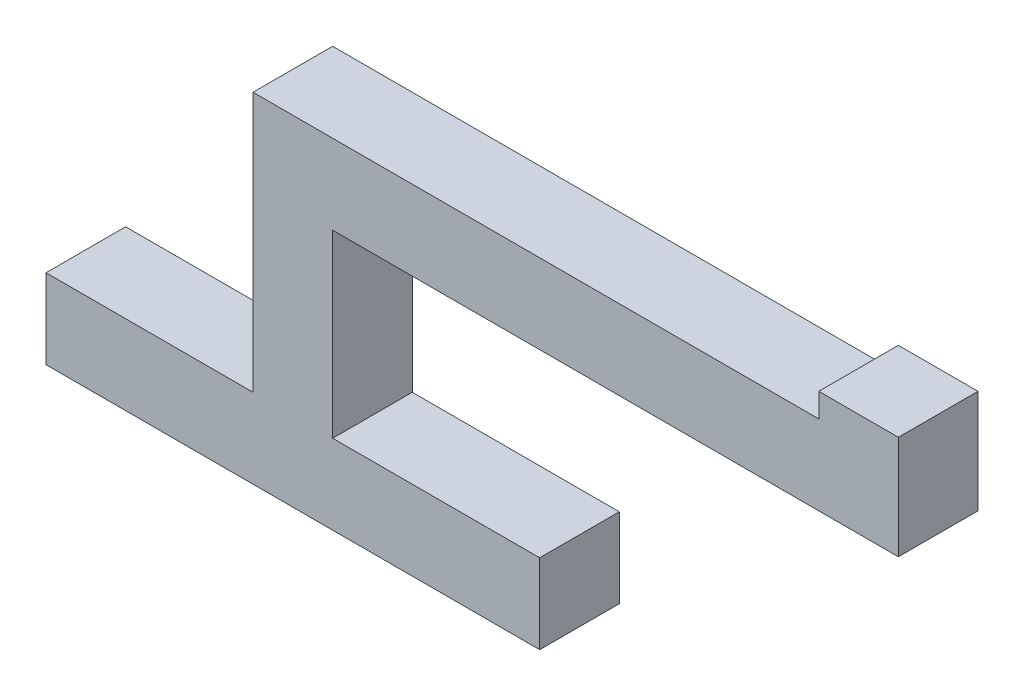
ISO-10303-21;
HEADER;
FILE_DESCRIPTION(('STEP AP214'),'2;1');
FILE_NAME('part.step','',(''),(''),'','','');
FILE_SCHEMA(('AUTOMOTIVE_DESIGN { 1 0 10303 214 1 1 1 1 }'));
ENDSEC;
DATA;
#1=APPLICATION_CONTEXT('core data for automotive mechanical design processes');
#2=APPLICATION_PROTOCOL_DEFINITION('international standard','automotive_design',2000,#1);
#3=PRODUCT_CONTEXT('',#1,'mechanical');
#4=PRODUCT('Part','Part','',(#3));
#5=PRODUCT_RELATED_PRODUCT_CATEGORY('part','',(#4));
#6=PRODUCT_DEFINITION_FORMATION('','',#4);
#7=PRODUCT_DEFINITION_CONTEXT('part definition',#1,'design');
#8=PRODUCT_DEFINITION('design','',#6,#7);
#9=PRODUCT_DEFINITION_SHAPE('','',#8);
#10=(LENGTH_UNIT() NAMED_UNIT(*) SI_UNIT(.MILLI.,.METRE.));
#11=(NAMED_UNIT(*) PLANE_ANGLE_UNIT() SI_UNIT($,.RADIAN.));
#12=(NAMED_UNIT(*) SI_UNIT($,.STERADIAN.) SOLID_ANGLE_UNIT());
#13=UNCERTAINTY_MEASURE_WITH_UNIT(LENGTH_MEASURE(1.E-05),#10,'distance_accuracy_value','');
#14=(GEOMETRIC_REPRESENTATION_CONTEXT(3) GLOBAL_UNCERTAINTY_ASSIGNED_CONTEXT((#13)) GLOBAL_UNIT_ASSIGNED_CONTEXT((#10,
#11,#12)) REPRESENTATION_CONTEXT('',''));
#15=CARTESIAN_POINT('',(0.,0.,0.));
#16=DIRECTION('',(0.,0.,1.));
#17=DIRECTION('',(1.,0.,0.));
#18=AXIS2_PLACEMENT_3D('',#15,#16,#17);
#19=CARTESIAN_POINT('',(-1.83420122950857,8.1168469934758,10.));
#20=DIRECTION('',(0.,-1.,0.));
#21=DIRECTION('',(1.,0.,0.));
#22=AXIS2_PLACEMENT_3D('',#19,#20,#21);
#23=PLANE('',#22);
#24=DIRECTION('',(-1.,0.,0.));
#25=VECTOR('',#24,1.);
#26=CARTESIAN_POINT('',(-1.83420122950857,8.1168469934758,0.));
#27=LINE('',#26,#25);
#28=CARTESIAN_POINT('',(-1.83420122950857,8.1168469934758,0.));
#29=VERTEX_POINT('',#28);
#30=CARTESIAN_POINT('',(-27.8342012295086,8.1168469934758,0.));
#31=VERTEX_POINT('',#30);
#32=EDGE_CURVE('E157',#29,#31,#27,.T.);
#33=ORIENTED_EDGE('',*,*,#32,.T.);
#34=DIRECTION('',(0.,0.,-1.));
#35=VECTOR('',#34,1.);
#36=CARTESIAN_POINT('',(-27.8342012295086,8.1168469934758,10.));
#37=LINE('',#36,#35);
#38=CARTESIAN_POINT('',(-27.8342012295086,8.1168469934758,10.));
#39=VERTEX_POINT('',#38);
#40=EDGE_CURVE('E11',#39,#31,#37,.T.);
#41=ORIENTED_EDGE('',*,*,#40,.F.);
#42=DIRECTION('',(-1.,0.,0.));
#43=VECTOR('',#42,1.);
#44=CARTESIAN_POINT('',(-1.83420122950857,8.1168469934758,10.));
#45=LINE('',#44,#43);
#46=CARTESIAN_POINT('',(-1.83420122950857,8.1168469934758,10.));
#47=VERTEX_POINT('',#46);
#48=EDGE_CURVE('E180',#47,#39,#45,.T.);
#49=ORIENTED_EDGE('',*,*,#48,.F.);
#50=DIRECTION('',(0.,0.,-1.));
#51=VECTOR('',#50,1.);
#52=CARTESIAN_POINT('',(-1.83420122950857,8.1168469934758,10.));
#53=LINE('',#52,#51);
#54=EDGE_CURVE('E153',#47,#29,#53,.T.);
#55=ORIENTED_EDGE('',*,*,#54,.T.);
#56=EDGE_LOOP('',(#33,#41,#49,#55));
#57=FACE_BOUND('',#56,.T.);
#58=ADVANCED_FACE('F37',(#57),#23,.F.);
#59=CARTESIAN_POINT('',(-27.8342012295086,8.1168469934758,10.));
#60=DIRECTION('',(-1.,0.,0.));
#61=DIRECTION('',(0.,0.,1.));
#62=AXIS2_PLACEMENT_3D('',#59,#60,#61);
#63=PLANE('',#62);
#64=DIRECTION('',(0.,1.,0.));
#65=VECTOR('',#64,1.);
#66=CARTESIAN_POINT('',(-27.8342012295086,8.1168469934758,0.));
#67=LINE('',#66,#65);
#68=CARTESIAN_POINT('',(-27.8342012295086,30.7475326280275,0.));
#69=VERTEX_POINT('',#68);
#70=EDGE_CURVE('E160',#31,#69,#67,.T.);
#71=ORIENTED_EDGE('',*,*,#70,.T.);
#72=DIRECTION('',(0.,0.,-1.));
#73=VECTOR('',#72,1.);
#74=CARTESIAN_POINT('',(-27.8342012295086,30.7475326280275,10.));
#75=LINE('',#74,#73);
#76=CARTESIAN_POINT('',(-27.8342012295086,30.7475326280275,10.));
#77=VERTEX_POINT('',#76);
#78=EDGE_CURVE('E45',#77,#69,#75,.T.);
#79=ORIENTED_EDGE('',*,*,#78,.F.);
#80=DIRECTION('',(0.,1.,0.));
#81=VECTOR('',#80,1.);
#82=CARTESIAN_POINT('',(-27.8342012295086,8.1168469934758,10.));
#83=LINE('',#82,#81);
#84=EDGE_CURVE('E108',#39,#77,#83,.T.);
#85=ORIENTED_EDGE('',*,*,#84,.F.);
#86=ORIENTED_EDGE('',*,*,#40,.T.);
#87=EDGE_LOOP('',(#71,#79,#85,#86));
#88=FACE_BOUND('',#87,.T.);
#89=ADVANCED_FACE('F207',(#88),#63,.F.);
#90=CARTESIAN_POINT('',(43.2157361526776,30.7475326280275,10.));
#91=DIRECTION('',(0.,1.,0.));
#92=DIRECTION('',(-1.,0.,0.));
#93=AXIS2_PLACEMENT_3D('',#90,#91,#92);
#94=PLANE('',#93);
#95=DIRECTION('',(1.,0.,0.));
#96=VECTOR('',#95,1.);
#97=CARTESIAN_POINT('',(43.2157361526776,30.7475326280275,0.));
#98=LINE('',#97,#96);
#99=CARTESIAN_POINT('',(43.2157361526776,30.7475326280275,0.));
#100=VERTEX_POINT('',#99);
#101=EDGE_CURVE('E163',#69,#100,#98,.T.);
#102=ORIENTED_EDGE('',*,*,#101,.T.);
#103=DIRECTION('',(0.,0.,-1.));
#104=VECTOR('',#103,1.);
#105=CARTESIAN_POINT('',(43.2157361526776,30.7475326280275,10.));
#106=LINE('',#105,#104);
#107=CARTESIAN_POINT('',(43.2157361526776,30.7475326280275,10.));
#108=VERTEX_POINT('',#107);
#109=EDGE_CURVE('E199',#108,#100,#106,.T.);
#110=ORIENTED_EDGE('',*,*,#109,.F.);
#111=DIRECTION('',(1.,0.,0.));
#112=VECTOR('',#111,1.);
#113=CARTESIAN_POINT('',(2.42414735958686,30.7475326280275,10.));
#114=LINE('',#113,#112);
#115=EDGE_CURVE('E206',#77,#108,#114,.T.);
#116=ORIENTED_EDGE('',*,*,#115,.F.);
#117=ORIENTED_EDGE('',*,*,#78,.T.);
#118=EDGE_LOOP('',(#102,#110,#116,#117));
#119=FACE_BOUND('',#118,.T.);
#120=ADVANCED_FACE('F204',(#119),#94,.F.);
#121=CARTESIAN_POINT('',(43.2157361526776,30.7475326280275,10.));
#122=DIRECTION('',(-1.,0.,0.));
#123=DIRECTION('',(0.,0.,1.));
#124=AXIS2_PLACEMENT_3D('',#121,#122,#123);
#125=PLANE('',#124);
#126=DIRECTION('',(0.,1.,0.));
#127=VECTOR('',#126,1.);
#128=CARTESIAN_POINT('',(43.2157361526776,30.7475326280275,0.));
#129=LINE('',#128,#127);
#130=CARTESIAN_POINT('',(43.2157361526776,43.7475326280275,0.));
#131=VERTEX_POINT('',#130);
#132=EDGE_CURVE('E165',#100,#131,#129,.T.);
#133=ORIENTED_EDGE('',*,*,#132,.T.);
#134=DIRECTION('',(0.,0.,-1.));
#135=VECTOR('',#134,1.);
#136=CARTESIAN_POINT('',(43.2157361526776,43.7475326280275,10.));
#137=LINE('',#136,#135);
#138=CARTESIAN_POINT('',(43.2157361526776,43.7475326280275,10.));
#139=VERTEX_POINT('',#138);
#140=EDGE_CURVE('E196',#139,#131,#137,.T.);
#141=ORIENTED_EDGE('',*,*,#140,.F.);
#142=DIRECTION('',(0.,1.,0.));
#143=VECTOR('',#142,1.);
#144=CARTESIAN_POINT('',(43.2157361526776,30.7475326280275,10.));
#145=LINE('',#144,#143);
#146=EDGE_CURVE('E226',#108,#139,#145,.T.);
#147=ORIENTED_EDGE('',*,*,#146,.F.);
#148=ORIENTED_EDGE('',*,*,#109,.T.);
#149=EDGE_LOOP('',(#133,#141,#147,#148));
#150=FACE_BOUND('',#149,.T.);
#151=ADVANCED_FACE('F217',(#150),#125,.F.);
#152=CARTESIAN_POINT('',(33.2157361526776,43.7475326280275,10.));
#153=DIRECTION('',(0.,-1.,0.));
#154=DIRECTION('',(0.,0.,-1.));
#155=AXIS2_PLACEMENT_3D('',#152,#153,#154);
#156=PLANE('',#155);
#157=DIRECTION('',(-1.,0.,0.));
#158=VECTOR('',#157,1.);
#159=CARTESIAN_POINT('',(33.2157361526776,43.7475326280275,0.));
#160=LINE('',#159,#158);
#161=CARTESIAN_POINT('',(33.2157361526776,43.7475326280275,0.));
#162=VERTEX_POINT('',#161);
#163=EDGE_CURVE('E167',#131,#162,#160,.T.);
#164=ORIENTED_EDGE('',*,*,#163,.T.);
#165=DIRECTION('',(0.,0.,-1.));
#166=VECTOR('',#165,1.);
#167=CARTESIAN_POINT('',(33.2157361526776,43.7475326280275,10.));
#168=LINE('',#167,#166);
#169=CARTESIAN_POINT('',(33.2157361526776,43.7475326280275,10.));
#170=VERTEX_POINT('',#169);
#171=EDGE_CURVE('E193',#170,#162,#168,.T.);
#172=ORIENTED_EDGE('',*,*,#171,.F.);
#173=DIRECTION('',(-1.,0.,0.));
#174=VECTOR('',#173,1.);
#175=CARTESIAN_POINT('',(33.2157361526776,43.7475326280275,10.));
#176=LINE('',#175,#174);
#177=EDGE_CURVE('E223',#139,#170,#176,.T.);
#178=ORIENTED_EDGE('',*,*,#177,.F.);
#179=ORIENTED_EDGE('',*,*,#140,.T.);
#180=EDGE_LOOP('',(#164,#172,#178,#179));
#181=FACE_BOUND('',#180,.T.);
#182=ADVANCED_FACE('F221',(#181),#156,.F.);
#183=CARTESIAN_POINT('',(33.2157361526776,40.7475326280275,10.));
#184=DIRECTION('',(1.,0.,0.));
#185=DIRECTION('',(0.,0.,-1.));
#186=AXIS2_PLACEMENT_3D('',#183,#184,#185);
#187=PLANE('',#186);
#188=DIRECTION('',(0.,-1.,0.));
#189=VECTOR('',#188,1.);
#190=CARTESIAN_POINT('',(33.2157361526776,40.7475326280275,0.));
#191=LINE('',#190,#189);
#192=CARTESIAN_POINT('',(33.2157361526776,40.7475326280275,0.));
#193=VERTEX_POINT('',#192);
#194=EDGE_CURVE('E169',#162,#193,#191,.T.);
#195=ORIENTED_EDGE('',*,*,#194,.T.);
#196=DIRECTION('',(0.,0.,-1.));
#197=VECTOR('',#196,1.);
#198=CARTESIAN_POINT('',(33.2157361526776,40.7475326280275,10.));
#199=LINE('',#198,#197);
#200=CARTESIAN_POINT('',(33.2157361526776,40.7475326280275,10.));
#201=VERTEX_POINT('',#200);
#202=EDGE_CURVE('E190',#201,#193,#199,.T.);
#203=ORIENTED_EDGE('',*,*,#202,.F.);
#204=DIRECTION('',(0.,-1.,0.));
#205=VECTOR('',#204,1.);
#206=CARTESIAN_POINT('',(33.2157361526776,40.7475326280275,10.));
#207=LINE('',#206,#205);
#208=EDGE_CURVE('E225',#170,#201,#207,.T.);
#209=ORIENTED_EDGE('',*,*,#208,.F.);
#210=ORIENTED_EDGE('',*,*,#171,.T.);
#211=EDGE_LOOP('',(#195,#203,#209,#210));
#212=FACE_BOUND('',#211,.T.);
#213=ADVANCED_FACE('F250',(#212),#187,.F.);
#214=CARTESIAN_POINT('',(33.2157361526776,40.7475326280275,10.));
#215=DIRECTION('',(0.,-1.,0.));
#216=DIRECTION('',(1.,0.,0.));
#217=AXIS2_PLACEMENT_3D('',#214,#215,#216);
#218=PLANE('',#217);
#219=DIRECTION('',(-1.,0.,0.));
#220=VECTOR('',#219,1.);
#221=CARTESIAN_POINT('',(33.2157361526776,40.7475326280275,0.));
#222=LINE('',#221,#220);
#223=CARTESIAN_POINT('',(-37.8342012295086,40.7475326280275,0.));
#224=VERTEX_POINT('',#223);
#225=EDGE_CURVE('E171',#193,#224,#222,.T.);
#226=ORIENTED_EDGE('',*,*,#225,.T.);
#227=DIRECTION('',(0.,0.,-1.));
#228=VECTOR('',#227,1.);
#229=CARTESIAN_POINT('',(-37.8342012295086,40.7475326280275,10.));
#230=LINE('',#229,#228);
#231=CARTESIAN_POINT('',(-37.8342012295086,40.7475326280275,10.));
#232=VERTEX_POINT('',#231);
#233=EDGE_CURVE('E187',#232,#224,#230,.T.);
#234=ORIENTED_EDGE('',*,*,#233,.F.);
#235=DIRECTION('',(-1.,0.,0.));
#236=VECTOR('',#235,1.);
#237=CARTESIAN_POINT('',(33.2157361526776,40.7475326280275,10.));
#238=LINE('',#237,#236);
#239=EDGE_CURVE('E228',#201,#232,#238,.T.);
#240=ORIENTED_EDGE('',*,*,#239,.F.);
#241=ORIENTED_EDGE('',*,*,#202,.T.);
#242=EDGE_LOOP('',(#226,#234,#240,#241));
#243=FACE_BOUND('',#242,.T.);
#244=ADVANCED_FACE('F247',(#243),#218,.F.);
#245=CARTESIAN_POINT('',(-37.8342012295086,8.1168469934758,10.));
#246=DIRECTION('',(1.,0.,0.));
#247=DIRECTION('',(0.,0.,-1.));
#248=AXIS2_PLACEMENT_3D('',#245,#246,#247);
#249=PLANE('',#248);
#250=DIRECTION('',(0.,-1.,0.));
#251=VECTOR('',#250,1.);
#252=CARTESIAN_POINT('',(-37.8342012295086,8.1168469934758,0.));
#253=LINE('',#252,#251);
#254=CARTESIAN_POINT('',(-37.8342012295086,8.1168469934758,0.));
#255=VERTEX_POINT('',#254);
#256=EDGE_CURVE('E173',#224,#255,#253,.T.);
#257=ORIENTED_EDGE('',*,*,#256,.T.);
#258=DIRECTION('',(0.,0.,-1.));
#259=VECTOR('',#258,1.);
#260=CARTESIAN_POINT('',(-37.8342012295086,8.1168469934758,10.));
#261=LINE('',#260,#259);
#262=CARTESIAN_POINT('',(-37.8342012295086,8.1168469934758,10.));
#263=VERTEX_POINT('',#262);
#264=EDGE_CURVE('E184',#263,#255,#261,.T.);
#265=ORIENTED_EDGE('',*,*,#264,.F.);
#266=DIRECTION('',(0.,-1.,0.));
#267=VECTOR('',#266,1.);
#268=CARTESIAN_POINT('',(-37.8342012295086,8.1168469934758,10.));
#269=LINE('',#268,#267);
#270=EDGE_CURVE('E234',#232,#263,#269,.T.);
#271=ORIENTED_EDGE('',*,*,#270,.F.);
#272=ORIENTED_EDGE('',*,*,#233,.T.);
#273=EDGE_LOOP('',(#257,#265,#271,#272));
#274=FACE_BOUND('',#273,.T.);
#275=ADVANCED_FACE('F240',(#274),#249,.F.);
#276=CARTESIAN_POINT('',(-37.8342012295086,8.1168469934758,10.));
#277=DIRECTION('',(0.,-1.,0.));
#278=DIRECTION('',(1.,0.,0.));
#279=AXIS2_PLACEMENT_3D('',#276,#277,#278);
#280=PLANE('',#279);
#281=DIRECTION('',(-1.,0.,0.));
#282=VECTOR('',#281,1.);
#283=CARTESIAN_POINT('',(-37.8342012295086,8.1168469934758,0.));
#284=LINE('',#283,#282);
#285=CARTESIAN_POINT('',(-63.8342012295086,8.1168469934758,0.));
#286=VERTEX_POINT('',#285);
#287=EDGE_CURVE('E175',#255,#286,#284,.T.);
#288=ORIENTED_EDGE('',*,*,#287,.T.);
#289=DIRECTION('',(0.,0.,-1.));
#290=VECTOR('',#289,1.);
#291=CARTESIAN_POINT('',(-63.8342012295086,8.1168469934758,10.));
#292=LINE('',#291,#290);
#293=CARTESIAN_POINT('',(-63.8342012295086,8.1168469934758,10.));
#294=VERTEX_POINT('',#293);
#295=EDGE_CURVE('E148',#294,#286,#292,.T.);
#296=ORIENTED_EDGE('',*,*,#295,.F.);
#297=DIRECTION('',(-1.,0.,0.));
#298=VECTOR('',#297,1.);
#299=CARTESIAN_POINT('',(-37.8342012295086,8.1168469934758,10.));
#300=LINE('',#299,#298);
#301=EDGE_CURVE('E139',#263,#294,#300,.T.);
#302=ORIENTED_EDGE('',*,*,#301,.F.);
#303=ORIENTED_EDGE('',*,*,#264,.T.);
#304=EDGE_LOOP('',(#288,#296,#302,#303));
#305=FACE_BOUND('',#304,.T.);
#306=ADVANCED_FACE('F244',(#305),#280,.F.);
#307=CARTESIAN_POINT('',(-63.8342012295086,8.1168469934758,10.));
#308=DIRECTION('',(1.,0.,0.));
#309=DIRECTION('',(0.,0.,-1.));
#310=AXIS2_PLACEMENT_3D('',#307,#308,#309);
#311=PLANE('',#310);
#312=DIRECTION('',(0.,-1.,0.));
#313=VECTOR('',#312,1.);
#314=CARTESIAN_POINT('',(-63.8342012295086,8.1168469934758,0.));
#315=LINE('',#314,#313);
#316=CARTESIAN_POINT('',(-63.8342012295086,-1.8831530065242,0.));
#317=VERTEX_POINT('',#316);
#318=EDGE_CURVE('E147',#286,#317,#315,.T.);
#319=ORIENTED_EDGE('',*,*,#318,.T.);
#320=DIRECTION('',(0.,0.,-1.));
#321=VECTOR('',#320,1.);
#322=CARTESIAN_POINT('',(-63.8342012295086,-1.8831530065242,10.));
#323=LINE('',#322,#321);
#324=CARTESIAN_POINT('',(-63.8342012295086,-1.8831530065242,10.));
#325=VERTEX_POINT('',#324);
#326=EDGE_CURVE('E144',#325,#317,#323,.T.);
#327=ORIENTED_EDGE('',*,*,#326,.F.);
#328=DIRECTION('',(0.,-1.,0.));
#329=VECTOR('',#328,1.);
#330=CARTESIAN_POINT('',(-63.8342012295086,8.1168469934758,10.));
#331=LINE('',#330,#329);
#332=EDGE_CURVE('E133',#294,#325,#331,.T.);
#333=ORIENTED_EDGE('',*,*,#332,.F.);
#334=ORIENTED_EDGE('',*,*,#295,.T.);
#335=EDGE_LOOP('',(#319,#327,#333,#334));
#336=FACE_BOUND('',#335,.T.);
#337=ADVANCED_FACE('F145',(#336),#311,.F.);
#338=CARTESIAN_POINT('',(-63.8342012295086,-1.8831530065242,10.));
#339=DIRECTION('',(0.,1.,0.));
#340=DIRECTION('',(0.,0.,1.));
#341=AXIS2_PLACEMENT_3D('',#338,#339,#340);
#342=PLANE('',#341);
#343=DIRECTION('',(1.,0.,0.));
#344=VECTOR('',#343,1.);
#345=CARTESIAN_POINT('',(-63.8342012295086,-1.8831530065242,0.));
#346=LINE('',#345,#344);
#347=CARTESIAN_POINT('',(-1.83420122950857,-1.8831530065242,0.));
#348=VERTEX_POINT('',#347);
#349=EDGE_CURVE('E94',#317,#348,#346,.T.);
#350=ORIENTED_EDGE('',*,*,#349,.T.);
#351=DIRECTION('',(0.,0.,-1.));
#352=VECTOR('',#351,1.);
#353=CARTESIAN_POINT('',(-1.83420122950857,-1.8831530065242,10.));
#354=LINE('',#353,#352);
#355=CARTESIAN_POINT('',(-1.83420122950857,-1.8831530065242,10.));
#356=VERTEX_POINT('',#355);
#357=EDGE_CURVE('E149',#356,#348,#354,.T.);
#358=ORIENTED_EDGE('',*,*,#357,.F.);
#359=DIRECTION('',(1.,0.,0.));
#360=VECTOR('',#359,1.);
#361=CARTESIAN_POINT('',(-63.8342012295086,-1.8831530065242,10.));
#362=LINE('',#361,#360);
#363=EDGE_CURVE('E137',#325,#356,#362,.T.);
#364=ORIENTED_EDGE('',*,*,#363,.F.);
#365=ORIENTED_EDGE('',*,*,#326,.T.);
#366=EDGE_LOOP('',(#350,#358,#364,#365));
#367=FACE_BOUND('',#366,.T.);
#368=ADVANCED_FACE('F151',(#367),#342,.F.);
#369=CARTESIAN_POINT('',(-1.83420122950857,-1.8831530065242,10.));
#370=DIRECTION('',(-1.,0.,0.));
#371=DIRECTION('',(0.,0.,1.));
#372=AXIS2_PLACEMENT_3D('',#369,#370,#371);
#373=PLANE('',#372);
#374=DIRECTION('',(0.,1.,0.));
#375=VECTOR('',#374,1.);
#376=CARTESIAN_POINT('',(-1.83420122950857,-1.8831530065242,0.));
#377=LINE('',#376,#375);
#378=EDGE_CURVE('E100',#348,#29,#377,.T.);
#379=ORIENTED_EDGE('',*,*,#378,.T.);
#380=ORIENTED_EDGE('',*,*,#54,.F.);
#381=DIRECTION('',(0.,1.,0.));
#382=VECTOR('',#381,1.);
#383=CARTESIAN_POINT('',(-1.83420122950857,-1.8831530065242,10.));
#384=LINE('',#383,#382);
#385=EDGE_CURVE('E53',#356,#47,#384,.T.);
#386=ORIENTED_EDGE('',*,*,#385,.F.);
#387=ORIENTED_EDGE('',*,*,#357,.T.);
#388=EDGE_LOOP('',(#379,#380,#386,#387));
#389=FACE_BOUND('',#388,.T.);
#390=ADVANCED_FACE('F265',(#389),#373,.F.);
#391=CARTESIAN_POINT('',(0.,0.,10.));
#392=DIRECTION('',(0.,0.,-1.));
#393=DIRECTION('',(-1.,0.,0.));
#394=AXIS2_PLACEMENT_3D('',#391,#392,#393);
#395=PLANE('',#394);
#396=ORIENTED_EDGE('',*,*,#48,.T.);
#397=ORIENTED_EDGE('',*,*,#84,.T.);
#398=ORIENTED_EDGE('',*,*,#115,.T.);
#399=ORIENTED_EDGE('',*,*,#146,.T.);
#400=ORIENTED_EDGE('',*,*,#177,.T.);
#401=ORIENTED_EDGE('',*,*,#208,.T.);
#402=ORIENTED_EDGE('',*,*,#239,.T.);
#403=ORIENTED_EDGE('',*,*,#270,.T.);
#404=ORIENTED_EDGE('',*,*,#301,.T.);
#405=ORIENTED_EDGE('',*,*,#332,.T.);
#406=ORIENTED_EDGE('',*,*,#363,.T.);
#407=ORIENTED_EDGE('',*,*,#385,.T.);
#408=EDGE_LOOP('',(#396,#397,#398,#399,#400,#401,#402,#403,#404,#405,#406,#407));
#409=FACE_BOUND('',#408,.T.);
#410=ADVANCED_FACE('F135',(#409),#395,.F.);
#411=CARTESIAN_POINT('',(0.,0.,0.));
#412=DIRECTION('',(0.,0.,-1.));
#413=DIRECTION('',(-1.,0.,0.));
#414=AXIS2_PLACEMENT_3D('',#411,#412,#413);
#415=PLANE('',#414);
#416=ORIENTED_EDGE('',*,*,#32,.F.);
#417=ORIENTED_EDGE('',*,*,#378,.F.);
#418=ORIENTED_EDGE('',*,*,#349,.F.);
#419=ORIENTED_EDGE('',*,*,#318,.F.);
#420=ORIENTED_EDGE('',*,*,#287,.F.);
#421=ORIENTED_EDGE('',*,*,#256,.F.);
#422=ORIENTED_EDGE('',*,*,#225,.F.);
#423=ORIENTED_EDGE('',*,*,#194,.F.);
#424=ORIENTED_EDGE('',*,*,#163,.F.);
#425=ORIENTED_EDGE('',*,*,#132,.F.);
#426=ORIENTED_EDGE('',*,*,#101,.F.);
#427=ORIENTED_EDGE('',*,*,#70,.F.);
#428=EDGE_LOOP('',(#416,#417,#418,#419,#420,#421,#422,#423,#424,#425,#426,#427));
#429=FACE_BOUND('',#428,.T.);
#430=ADVANCED_FACE('F211',(#429),#415,.T.);
#431=CLOSED_SHELL('',(#58,#89,#120,#151,#182,#213,#244,#275,#306,#337,#368,#390,#410,#430));
#432=MANIFOLD_SOLID_BREP('B2',#431);
#433=ADVANCED_BREP_SHAPE_REPRESENTATION('',(#18,#432),#14);
#434=SHAPE_DEFINITION_REPRESENTATION(#9,#433);
ENDSEC;
END-ISO-10303-21;
